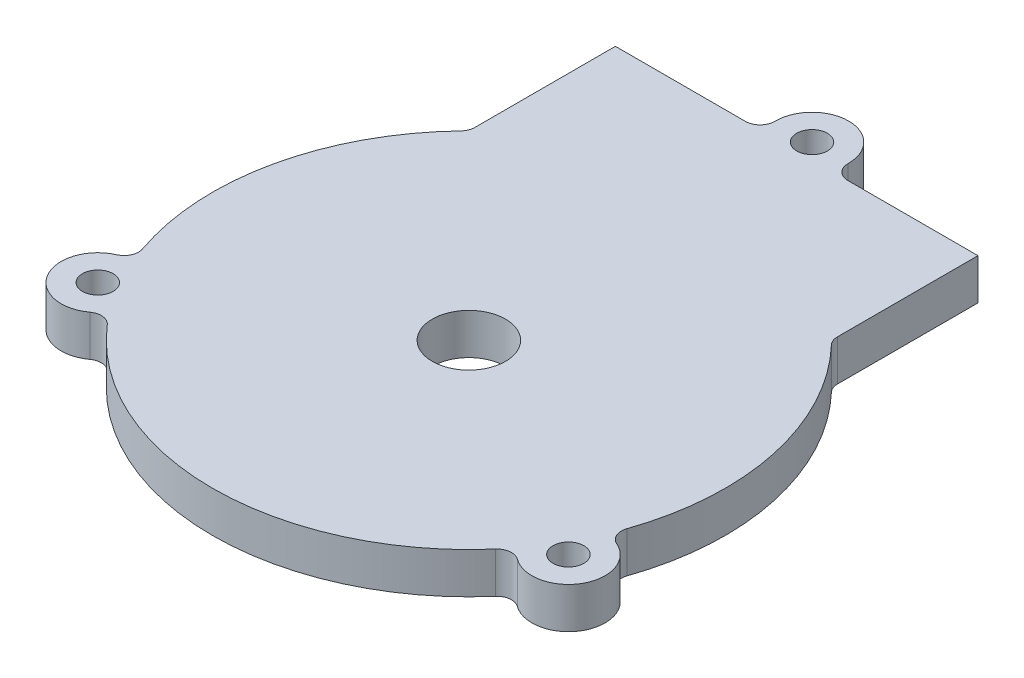
ISO-10303-21;
HEADER;
FILE_DESCRIPTION(('STEP AP214'),'2;1');
FILE_NAME('part.step','',(''),(''),'','','');
FILE_SCHEMA(('AUTOMOTIVE_DESIGN { 1 0 10303 214 1 1 1 1 }'));
ENDSEC;
DATA;
#1=APPLICATION_CONTEXT('core data for automotive mechanical design processes');
#2=APPLICATION_PROTOCOL_DEFINITION('international standard','automotive_design',2000,#1);
#3=PRODUCT_CONTEXT('',#1,'mechanical');
#4=PRODUCT('Part','Part','',(#3));
#5=PRODUCT_RELATED_PRODUCT_CATEGORY('part','',(#4));
#6=PRODUCT_DEFINITION_FORMATION('','',#4);
#7=PRODUCT_DEFINITION_CONTEXT('part definition',#1,'design');
#8=PRODUCT_DEFINITION('design','',#6,#7);
#9=PRODUCT_DEFINITION_SHAPE('','',#8);
#10=(LENGTH_UNIT() NAMED_UNIT(*) SI_UNIT(.MILLI.,.METRE.));
#11=(NAMED_UNIT(*) PLANE_ANGLE_UNIT() SI_UNIT($,.RADIAN.));
#12=(NAMED_UNIT(*) SI_UNIT($,.STERADIAN.) SOLID_ANGLE_UNIT());
#13=UNCERTAINTY_MEASURE_WITH_UNIT(LENGTH_MEASURE(1.E-05),#10,'distance_accuracy_value','');
#14=(GEOMETRIC_REPRESENTATION_CONTEXT(3) GLOBAL_UNCERTAINTY_ASSIGNED_CONTEXT((#13)) GLOBAL_UNIT_ASSIGNED_CONTEXT((#10,
#11,#12)) REPRESENTATION_CONTEXT('',''));
#15=CARTESIAN_POINT('',(0.,0.,0.));
#16=DIRECTION('',(0.,0.,1.));
#17=DIRECTION('',(1.,0.,0.));
#18=AXIS2_PLACEMENT_3D('',#15,#16,#17);
#19=CARTESIAN_POINT('',(0.,5.588,0.));
#20=DIRECTION('',(0.,-1.,0.));
#21=DIRECTION('',(0.,0.,-1.));
#22=AXIS2_PLACEMENT_3D('',#19,#20,#21);
#23=CYLINDRICAL_SURFACE('',#22,35.);
#24=CARTESIAN_POINT('',(0.,0.,0.));
#25=DIRECTION('',(0.,1.,0.));
#26=DIRECTION('',(0.,0.,1.));
#27=AXIS2_PLACEMENT_3D('',#24,#25,#26);
#28=CIRCLE('',#27,35.);
#29=CARTESIAN_POINT('',(-25.3019754085747,0.,-24.1828459951239));
#30=VERTEX_POINT('',#29);
#31=CARTESIAN_POINT('',(-33.072840065109,0.,11.4537002766671));
#32=VERTEX_POINT('',#31);
#33=EDGE_CURVE('E211',#30,#32,#28,.T.);
#34=ORIENTED_EDGE('',*,*,#33,.T.);
#35=DIRECTION('',(0.,-1.,0.));
#36=VECTOR('',#35,1.);
#37=CARTESIAN_POINT('',(-33.072840065109,5.588,11.4537002766671));
#38=LINE('',#37,#36);
#39=CARTESIAN_POINT('',(-33.072840065109,5.588,11.4537002766671));
#40=VERTEX_POINT('',#39);
#41=EDGE_CURVE('E224',#32,#40,#38,.F.);
#42=ORIENTED_EDGE('',*,*,#41,.T.);
#43=CARTESIAN_POINT('',(0.,5.588,0.));
#44=DIRECTION('',(0.,1.,0.));
#45=DIRECTION('',(0.,0.,1.));
#46=AXIS2_PLACEMENT_3D('',#43,#44,#45);
#47=CIRCLE('',#46,35.);
#48=CARTESIAN_POINT('',(-25.3019754085747,5.588,-24.1828459951239));
#49=VERTEX_POINT('',#48);
#50=EDGE_CURVE('E205',#49,#40,#47,.T.);
#51=ORIENTED_EDGE('',*,*,#50,.F.);
#52=DIRECTION('',(0.,-1.,0.));
#53=VECTOR('',#52,1.);
#54=CARTESIAN_POINT('',(-25.3019754085747,5.588,-24.1828459951239));
#55=LINE('',#54,#53);
#56=EDGE_CURVE('E218',#49,#30,#55,.T.);
#57=ORIENTED_EDGE('',*,*,#56,.T.);
#58=EDGE_LOOP('',(#34,#42,#51,#57));
#59=FACE_BOUND('',#58,.T.);
#60=ADVANCED_FACE('F42',(#59),#23,.T.);
#61=CARTESIAN_POINT('',(-26.5021889393046,0.,22.8611894140572));
#62=VERTEX_POINT('',#61);
#63=CARTESIAN_POINT('',(26.4887144081727,0.,22.8768006723464));
#64=VERTEX_POINT('',#63);
#65=EDGE_CURVE('E214',#62,#64,#28,.T.);
#66=ORIENTED_EDGE('',*,*,#65,.T.);
#67=DIRECTION('',(0.,-1.,0.));
#68=VECTOR('',#67,1.);
#69=CARTESIAN_POINT('',(26.4887144081727,5.588,22.8768006723464));
#70=LINE('',#69,#68);
#71=CARTESIAN_POINT('',(26.4887144081727,5.588,22.8768006723464));
#72=VERTEX_POINT('',#71);
#73=EDGE_CURVE('E243',#64,#72,#70,.F.);
#74=ORIENTED_EDGE('',*,*,#73,.T.);
#75=CARTESIAN_POINT('',(-26.5021889393046,5.588,22.8611894140572));
#76=VERTEX_POINT('',#75);
#77=EDGE_CURVE('E209',#76,#72,#47,.T.);
#78=ORIENTED_EDGE('',*,*,#77,.F.);
#79=DIRECTION('',(0.,-1.,0.));
#80=VECTOR('',#79,1.);
#81=CARTESIAN_POINT('',(-26.5021889393046,5.588,22.8611894140572));
#82=LINE('',#81,#80);
#83=EDGE_CURVE('E234',#76,#62,#82,.T.);
#84=ORIENTED_EDGE('',*,*,#83,.T.);
#85=EDGE_LOOP('',(#66,#74,#78,#84));
#86=FACE_BOUND('',#85,.T.);
#87=ADVANCED_FACE('F365',(#86),#23,.T.);
#88=CARTESIAN_POINT('',(-24.7478605121482,-53.381962685779,-44.7452325826062));
#89=DIRECTION('',(3.0206381024394E-06,0.,0.999999999995438));
#90=DIRECTION('',(0.999999999995438,0.,-3.0206381024394E-06));
#91=AXIS2_PLACEMENT_3D('',#88,#89,#90);
#92=PLANE('',#91);
#93=DIRECTION('',(0.999999999995438,0.,-3.0206381024394E-06));
#94=VECTOR('',#93,1.);
#95=CARTESIAN_POINT('',(-24.7478605121482,5.588,-44.7452325826062));
#96=LINE('',#95,#94);
#97=CARTESIAN_POINT('',(-24.7478605121482,5.588,-44.7452325826062));
#98=VERTEX_POINT('',#97);
#99=CARTESIAN_POINT('',(-6.99532394188785,5.588,-44.7452862065945));
#100=VERTEX_POINT('',#99);
#101=EDGE_CURVE('E177',#98,#100,#96,.T.);
#102=ORIENTED_EDGE('',*,*,#101,.T.);
#103=DIRECTION('',(0.,1.,0.));
#104=VECTOR('',#103,1.);
#105=CARTESIAN_POINT('',(-6.99532394188785,-53.381962685779,-44.7452862065945));
#106=LINE('',#105,#104);
#107=CARTESIAN_POINT('',(-6.99532394188785,0.,-44.7452862065945));
#108=VERTEX_POINT('',#107);
#109=EDGE_CURVE('E277',#100,#108,#106,.F.);
#110=ORIENTED_EDGE('',*,*,#109,.T.);
#111=DIRECTION('',(-0.999999999995438,0.,3.0206381024394E-06));
#112=VECTOR('',#111,1.);
#113=CARTESIAN_POINT('',(-24.7478605121482,0.,-44.7452325826062));
#114=LINE('',#113,#112);
#115=CARTESIAN_POINT('',(-24.7478605121482,0.,-44.7452325826062));
#116=VERTEX_POINT('',#115);
#117=EDGE_CURVE('E198',#108,#116,#114,.T.);
#118=ORIENTED_EDGE('',*,*,#117,.T.);
#119=DIRECTION('',(0.,1.,0.));
#120=VECTOR('',#119,1.);
#121=CARTESIAN_POINT('',(-24.7478605121482,-53.381962685779,-44.7452325826062));
#122=LINE('',#121,#120);
#123=EDGE_CURVE('E194',#116,#98,#122,.T.);
#124=ORIENTED_EDGE('',*,*,#123,.T.);
#125=EDGE_LOOP('',(#102,#110,#118,#124));
#126=FACE_BOUND('',#125,.T.);
#127=ADVANCED_FACE('F283',(#126),#92,.F.);
#128=CARTESIAN_POINT('',(33.0630730181294,0.,11.4818640733046));
#129=VERTEX_POINT('',#128);
#130=CARTESIAN_POINT('',(25.3018293128609,0.,-24.1829988509046));
#131=VERTEX_POINT('',#130);
#132=EDGE_CURVE('E215',#129,#131,#28,.T.);
#133=ORIENTED_EDGE('',*,*,#132,.T.);
#134=DIRECTION('',(0.,-1.,0.));
#135=VECTOR('',#134,1.);
#136=CARTESIAN_POINT('',(25.3018293128609,5.588,-24.1829988509046));
#137=LINE('',#136,#135);
#138=CARTESIAN_POINT('',(25.3018293128609,5.588,-24.1829988509046));
#139=VERTEX_POINT('',#138);
#140=EDGE_CURVE('E262',#131,#139,#137,.F.);
#141=ORIENTED_EDGE('',*,*,#140,.T.);
#142=CARTESIAN_POINT('',(33.0630730181294,5.588,11.4818640733046));
#143=VERTEX_POINT('',#142);
#144=EDGE_CURVE('E210',#143,#139,#47,.T.);
#145=ORIENTED_EDGE('',*,*,#144,.F.);
#146=DIRECTION('',(0.,-1.,0.));
#147=VECTOR('',#146,1.);
#148=CARTESIAN_POINT('',(33.0630730181294,5.588,11.4818640733046));
#149=LINE('',#148,#147);
#150=EDGE_CURVE('E253',#143,#129,#149,.T.);
#151=ORIENTED_EDGE('',*,*,#150,.T.);
#152=EDGE_LOOP('',(#133,#141,#145,#151));
#153=FACE_BOUND('',#152,.T.);
#154=ADVANCED_FACE('F342',(#153),#23,.T.);
#155=CARTESIAN_POINT('',(0.,5.588,0.));
#156=DIRECTION('',(0.,1.,0.));
#157=DIRECTION('',(0.,0.,1.));
#158=AXIS2_PLACEMENT_3D('',#155,#156,#157);
#159=PLANE('',#158);
#160=CARTESIAN_POINT('',(0.,5.588,0.));
#161=DIRECTION('',(0.,1.,0.));
#162=DIRECTION('',(0.,0.,1.));
#163=AXIS2_PLACEMENT_3D('',#160,#161,#162);
#164=CIRCLE('',#163,5.);
#165=CARTESIAN_POINT('',(0.,5.588,5.));
#166=VERTEX_POINT('',#165);
#167=EDGE_CURVE('E334',#166,#166,#164,.T.);
#168=ORIENTED_EDGE('',*,*,#167,.F.);
#169=EDGE_LOOP('',(#168));
#170=FACE_BOUND('',#169,.T.);
#171=CARTESIAN_POINT('',(-32.1480166138315,5.588,18.5087961651664));
#172=DIRECTION('',(0.,1.,0.));
#173=DIRECTION('',(0.,0.,1.));
#174=AXIS2_PLACEMENT_3D('',#171,#172,#173);
#175=CIRCLE('',#174,2.09999999999999);
#176=CARTESIAN_POINT('',(-32.1480166138315,5.588,20.6087961651664));
#177=VERTEX_POINT('',#176);
#178=EDGE_CURVE('E328',#177,#177,#175,.T.);
#179=ORIENTED_EDGE('',*,*,#178,.F.);
#180=EDGE_LOOP('',(#179));
#181=FACE_BOUND('',#180,.T.);
#182=DIRECTION('',(-3.02063810260161E-06,0.,-0.999999999995438));
#183=VECTOR('',#182,1.);
#184=CARTESIAN_POINT('',(-24.7478001128037,5.588,-24.7496745347634));
#185=LINE('',#184,#183);
#186=CARTESIAN_POINT('',(-24.7478025747881,5.588,-25.5647289504072));
#187=VERTEX_POINT('',#186);
#188=EDGE_CURVE('E195',#187,#98,#185,.T.);
#189=ORIENTED_EDGE('',*,*,#188,.F.);
#190=CARTESIAN_POINT('',(-26.747802574779,5.588,-25.564722909131));
#191=DIRECTION('',(0.,1.,0.));
#192=DIRECTION('',(0.,0.,1.));
#193=AXIS2_PLACEMENT_3D('',#190,#191,#192);
#194=CIRCLE('',#193,2.);
#195=EDGE_CURVE('E220',#187,#49,#194,.F.);
#196=ORIENTED_EDGE('',*,*,#195,.T.);
#197=ORIENTED_EDGE('',*,*,#50,.T.);
#198=CARTESIAN_POINT('',(-34.9627166402581,5.588,12.1081974353338));
#199=DIRECTION('',(0.,1.,0.));
#200=DIRECTION('',(0.,0.,1.));
#201=AXIS2_PLACEMENT_3D('',#198,#199,#200);
#202=CIRCLE('',#201,2.);
#203=CARTESIAN_POINT('',(-34.1580179965192,5.588,13.9391698799011));
#204=VERTEX_POINT('',#203);
#205=EDGE_CURVE('E230',#40,#204,#202,.F.);
#206=ORIENTED_EDGE('',*,*,#205,.T.);
#207=CARTESIAN_POINT('',(-32.1464555555357,5.588,18.5161819435163));
#208=DIRECTION('',(0.,1.,0.));
#209=DIRECTION('',(0.,0.,1.));
#210=AXIS2_PLACEMENT_3D('',#207,#208,#209);
#211=CIRCLE('',#210,4.99954226749351);
#212=CARTESIAN_POINT('',(-29.1966357044392,5.588,22.5527628891349));
#213=VERTEX_POINT('',#212);
#214=EDGE_CURVE('E322',#204,#213,#211,.T.);
#215=ORIENTED_EDGE('',*,*,#214,.T.);
#216=CARTESIAN_POINT('',(-28.0165997358363,5.588,24.1675430948605));
#217=DIRECTION('',(0.,1.,0.));
#218=DIRECTION('',(0.,0.,1.));
#219=AXIS2_PLACEMENT_3D('',#216,#217,#218);
#220=CIRCLE('',#219,2.);
#221=EDGE_CURVE('E241',#213,#76,#220,.F.);
#222=ORIENTED_EDGE('',*,*,#221,.T.);
#223=ORIENTED_EDGE('',*,*,#77,.T.);
#224=CARTESIAN_POINT('',(28.0023552314968,5.588,24.1840464250519));
#225=DIRECTION('',(0.,1.,0.));
#226=DIRECTION('',(0.,0.,1.));
#227=AXIS2_PLACEMENT_3D('',#224,#225,#226);
#228=CIRCLE('',#227,2.);
#229=CARTESIAN_POINT('',(29.184359284545,5.588,22.5707062815676));
#230=VERTEX_POINT('',#229);
#231=EDGE_CURVE('E249',#72,#230,#228,.F.);
#232=ORIENTED_EDGE('',*,*,#231,.T.);
#233=CARTESIAN_POINT('',(32.1364886347761,5.588,18.5412879583363));
#234=DIRECTION('',(0.,1.,0.));
#235=DIRECTION('',(0.,0.,1.));
#236=AXIS2_PLACEMENT_3D('',#233,#234,#235);
#237=CIRCLE('',#236,4.9951255964279);
#238=CARTESIAN_POINT('',(34.147287178261,5.588,13.9687647007018));
#239=VERTEX_POINT('',#238);
#240=EDGE_CURVE('E311',#230,#239,#237,.T.);
#241=ORIENTED_EDGE('',*,*,#240,.T.);
#242=CARTESIAN_POINT('',(34.9523914763083,5.588,12.1379705917791));
#243=DIRECTION('',(0.,1.,0.));
#244=DIRECTION('',(0.,0.,1.));
#245=AXIS2_PLACEMENT_3D('',#242,#243,#244);
#246=CIRCLE('',#245,2.);
#247=EDGE_CURVE('E260',#239,#143,#246,.F.);
#248=ORIENTED_EDGE('',*,*,#247,.T.);
#249=ORIENTED_EDGE('',*,*,#144,.T.);
#250=CARTESIAN_POINT('',(26.7476481307387,5.588,-25.5648844995277));
#251=DIRECTION('',(0.,1.,0.));
#252=DIRECTION('',(0.,0.,1.));
#253=AXIS2_PLACEMENT_3D('',#250,#251,#252);
#254=CIRCLE('',#253,2.);
#255=CARTESIAN_POINT('',(24.7476481307478,5.588,-25.5648784582515));
#256=VERTEX_POINT('',#255);
#257=EDGE_CURVE('E185',#139,#256,#254,.F.);
#258=ORIENTED_EDGE('',*,*,#257,.T.);
#259=DIRECTION('',(-3.02063810260161E-06,0.,-0.999999999995438));
#260=VECTOR('',#259,1.);
#261=CARTESIAN_POINT('',(24.7476505927322,5.588,-24.7498240426077));
#262=LINE('',#261,#260);
#263=CARTESIAN_POINT('',(24.7475901933877,5.588,-44.7453820904505));
#264=VERTEX_POINT('',#263);
#265=EDGE_CURVE('E178',#256,#264,#262,.T.);
#266=ORIENTED_EDGE('',*,*,#265,.T.);
#267=CARTESIAN_POINT('',(6.99533660471705,5.588,-44.7453284673169));
#268=VERTEX_POINT('',#267);
#269=EDGE_CURVE('E168',#268,#264,#96,.T.);
#270=ORIENTED_EDGE('',*,*,#269,.F.);
#271=CARTESIAN_POINT('',(6.99533056344084,5.588,-46.7453284673078));
#272=DIRECTION('',(0.,1.,0.));
#273=DIRECTION('',(0.,0.,1.));
#274=AXIS2_PLACEMENT_3D('',#271,#272,#273);
#275=CIRCLE('',#274,2.);
#276=CARTESIAN_POINT('',(4.99551899083441,5.588,-46.7727815922561));
#277=VERTEX_POINT('',#276);
#278=EDGE_CURVE('E273',#268,#277,#275,.F.);
#279=ORIENTED_EDGE('',*,*,#278,.T.);
#280=CARTESIAN_POINT('',(0.,5.588,-46.8413593567393));
#281=DIRECTION('',(0.,1.,0.));
#282=DIRECTION('',(0.,0.,1.));
#283=AXIS2_PLACEMENT_3D('',#280,#281,#282);
#284=CIRCLE('',#283,4.99598968149142);
#285=CARTESIAN_POINT('',(-4.99551857644603,5.588,-46.7727514129473));
#286=VERTEX_POINT('',#285);
#287=EDGE_CURVE('E300',#277,#286,#284,.T.);
#288=ORIENTED_EDGE('',*,*,#287,.T.);
#289=CARTESIAN_POINT('',(-6.99532998316405,5.588,-46.7452862065854));
#290=DIRECTION('',(0.,1.,0.));
#291=DIRECTION('',(0.,0.,1.));
#292=AXIS2_PLACEMENT_3D('',#289,#290,#291);
#293=CIRCLE('',#292,2.);
#294=EDGE_CURVE('E12',#286,#100,#293,.F.);
#295=ORIENTED_EDGE('',*,*,#294,.T.);
#296=ORIENTED_EDGE('',*,*,#101,.F.);
#297=EDGE_LOOP('',(#189,#196,#197,#206,#215,#222,#223,#232,#241,#248,#249,#258,#266,#270,#279,
#288,#295,#296));
#298=FACE_BOUND('',#297,.T.);
#299=CARTESIAN_POINT('',(32.1247811991366,5.588,18.5356173256723));
#300=DIRECTION('',(0.,1.,0.));
#301=DIRECTION('',(0.,0.,1.));
#302=AXIS2_PLACEMENT_3D('',#299,#300,#301);
#303=CIRCLE('',#302,2.1);
#304=CARTESIAN_POINT('',(32.1247811991366,5.588,20.6356173256723));
#305=VERTEX_POINT('',#304);
#306=EDGE_CURVE('E317',#305,#305,#303,.T.);
#307=ORIENTED_EDGE('',*,*,#306,.F.);
#308=EDGE_LOOP('',(#307));
#309=FACE_BOUND('',#308,.T.);
#310=CARTESIAN_POINT('',(0.,5.588,-46.8413593567393));
#311=DIRECTION('',(0.,1.,0.));
#312=DIRECTION('',(0.,0.,1.));
#313=AXIS2_PLACEMENT_3D('',#310,#311,#312);
#314=CIRCLE('',#313,2.09605202456873);
#315=CARTESIAN_POINT('',(0.,5.588,-44.7453073321706));
#316=VERTEX_POINT('',#315);
#317=EDGE_CURVE('E304',#316,#316,#314,.T.);
#318=ORIENTED_EDGE('',*,*,#317,.F.);
#319=EDGE_LOOP('',(#318));
#320=FACE_BOUND('',#319,.T.);
#321=ADVANCED_FACE('F182',(#170,#181,#298,#309,#320),#159,.T.);
#322=CARTESIAN_POINT('',(0.,0.,0.));
#323=DIRECTION('',(0.,1.,0.));
#324=DIRECTION('',(0.,0.,1.));
#325=AXIS2_PLACEMENT_3D('',#322,#323,#324);
#326=PLANE('',#325);
#327=CARTESIAN_POINT('',(0.,0.,0.));
#328=DIRECTION('',(0.,1.,0.));
#329=DIRECTION('',(0.,0.,1.));
#330=AXIS2_PLACEMENT_3D('',#327,#328,#329);
#331=CIRCLE('',#330,5.);
#332=CARTESIAN_POINT('',(0.,0.,5.));
#333=VERTEX_POINT('',#332);
#334=EDGE_CURVE('E331',#333,#333,#331,.F.);
#335=ORIENTED_EDGE('',*,*,#334,.F.);
#336=EDGE_LOOP('',(#335));
#337=FACE_BOUND('',#336,.T.);
#338=CARTESIAN_POINT('',(-32.1480166138315,0.,18.5087961651664));
#339=DIRECTION('',(0.,1.,0.));
#340=DIRECTION('',(0.,0.,1.));
#341=AXIS2_PLACEMENT_3D('',#338,#339,#340);
#342=CIRCLE('',#341,2.1);
#343=CARTESIAN_POINT('',(-32.1480166138315,0.,20.6087961651664));
#344=VERTEX_POINT('',#343);
#345=EDGE_CURVE('E325',#344,#344,#342,.T.);
#346=ORIENTED_EDGE('',*,*,#345,.T.);
#347=EDGE_LOOP('',(#346));
#348=FACE_BOUND('',#347,.T.);
#349=CARTESIAN_POINT('',(32.1247811991366,0.,18.5356173256723));
#350=DIRECTION('',(0.,1.,0.));
#351=DIRECTION('',(0.,0.,1.));
#352=AXIS2_PLACEMENT_3D('',#349,#350,#351);
#353=CIRCLE('',#352,2.1);
#354=CARTESIAN_POINT('',(32.1247811991366,0.,20.6356173256723));
#355=VERTEX_POINT('',#354);
#356=EDGE_CURVE('E314',#355,#355,#353,.T.);
#357=ORIENTED_EDGE('',*,*,#356,.T.);
#358=EDGE_LOOP('',(#357));
#359=FACE_BOUND('',#358,.T.);
#360=CARTESIAN_POINT('',(0.,0.,-46.8413593567393));
#361=DIRECTION('',(0.,1.,0.));
#362=DIRECTION('',(0.,0.,1.));
#363=AXIS2_PLACEMENT_3D('',#360,#361,#362);
#364=CIRCLE('',#363,2.09605202456873);
#365=CARTESIAN_POINT('',(0.,0.,-44.7453073321706));
#366=VERTEX_POINT('',#365);
#367=EDGE_CURVE('E302',#366,#366,#364,.T.);
#368=ORIENTED_EDGE('',*,*,#367,.T.);
#369=EDGE_LOOP('',(#368));
#370=FACE_BOUND('',#369,.T.);
#371=ORIENTED_EDGE('',*,*,#65,.F.);
#372=CARTESIAN_POINT('',(-28.0165997358363,0.,24.1675430948605));
#373=DIRECTION('',(0.,1.,0.));
#374=DIRECTION('',(0.,0.,1.));
#375=AXIS2_PLACEMENT_3D('',#372,#373,#374);
#376=CIRCLE('',#375,2.);
#377=CARTESIAN_POINT('',(-29.1966357044392,0.,22.5527628891349));
#378=VERTEX_POINT('',#377);
#379=EDGE_CURVE('E239',#62,#378,#376,.T.);
#380=ORIENTED_EDGE('',*,*,#379,.T.);
#381=CARTESIAN_POINT('',(-32.1464555555357,0.,18.5161819435163));
#382=DIRECTION('',(0.,1.,0.));
#383=DIRECTION('',(0.,0.,1.));
#384=AXIS2_PLACEMENT_3D('',#381,#382,#383);
#385=CIRCLE('',#384,4.99954226749351);
#386=CARTESIAN_POINT('',(-34.1580179965192,0.,13.9391698799011));
#387=VERTEX_POINT('',#386);
#388=EDGE_CURVE('E320',#378,#387,#385,.F.);
#389=ORIENTED_EDGE('',*,*,#388,.T.);
#390=CARTESIAN_POINT('',(-34.9627166402581,0.,12.1081974353338));
#391=DIRECTION('',(0.,1.,0.));
#392=DIRECTION('',(0.,0.,1.));
#393=AXIS2_PLACEMENT_3D('',#390,#391,#392);
#394=CIRCLE('',#393,2.);
#395=EDGE_CURVE('E232',#387,#32,#394,.T.);
#396=ORIENTED_EDGE('',*,*,#395,.T.);
#397=ORIENTED_EDGE('',*,*,#33,.F.);
#398=CARTESIAN_POINT('',(-26.747802574779,0.,-25.564722909131));
#399=DIRECTION('',(0.,1.,0.));
#400=DIRECTION('',(0.,0.,1.));
#401=AXIS2_PLACEMENT_3D('',#398,#399,#400);
#402=CIRCLE('',#401,2.);
#403=CARTESIAN_POINT('',(-24.7478025747881,0.,-25.5647289504072));
#404=VERTEX_POINT('',#403);
#405=EDGE_CURVE('E222',#30,#404,#402,.T.);
#406=ORIENTED_EDGE('',*,*,#405,.T.);
#407=DIRECTION('',(3.02063810260161E-06,0.,0.999999999995438));
#408=VECTOR('',#407,1.);
#409=CARTESIAN_POINT('',(-24.7478001128037,0.,-24.7496745347634));
#410=LINE('',#409,#408);
#411=EDGE_CURVE('E204',#116,#404,#410,.T.);
#412=ORIENTED_EDGE('',*,*,#411,.F.);
#413=ORIENTED_EDGE('',*,*,#117,.F.);
#414=CARTESIAN_POINT('',(-6.99532998316405,0.,-46.7452862065854));
#415=DIRECTION('',(0.,1.,0.));
#416=DIRECTION('',(0.,0.,1.));
#417=AXIS2_PLACEMENT_3D('',#414,#415,#416);
#418=CIRCLE('',#417,2.);
#419=CARTESIAN_POINT('',(-4.99551857644603,0.,-46.7727514129473));
#420=VERTEX_POINT('',#419);
#421=EDGE_CURVE('E50',#108,#420,#418,.T.);
#422=ORIENTED_EDGE('',*,*,#421,.T.);
#423=CARTESIAN_POINT('',(0.,0.,-46.8413593567393));
#424=DIRECTION('',(0.,1.,0.));
#425=DIRECTION('',(0.,0.,1.));
#426=AXIS2_PLACEMENT_3D('',#423,#424,#425);
#427=CIRCLE('',#426,4.99598968149142);
#428=CARTESIAN_POINT('',(4.99551899083441,0.,-46.7727815922561));
#429=VERTEX_POINT('',#428);
#430=EDGE_CURVE('E188',#429,#420,#427,.T.);
#431=ORIENTED_EDGE('',*,*,#430,.F.);
#432=CARTESIAN_POINT('',(6.99533056344084,0.,-46.7453284673078));
#433=DIRECTION('',(0.,1.,0.));
#434=DIRECTION('',(0.,0.,1.));
#435=AXIS2_PLACEMENT_3D('',#432,#433,#434);
#436=CIRCLE('',#435,2.);
#437=CARTESIAN_POINT('',(6.99533660471705,0.,-44.7453284673169));
#438=VERTEX_POINT('',#437);
#439=EDGE_CURVE('E275',#429,#438,#436,.T.);
#440=ORIENTED_EDGE('',*,*,#439,.T.);
#441=CARTESIAN_POINT('',(24.7475901933877,0.,-44.7453820904505));
#442=VERTEX_POINT('',#441);
#443=EDGE_CURVE('E202',#442,#438,#114,.T.);
#444=ORIENTED_EDGE('',*,*,#443,.F.);
#445=DIRECTION('',(3.02063810260161E-06,0.,0.999999999995438));
#446=VECTOR('',#445,1.);
#447=CARTESIAN_POINT('',(24.7476505927322,0.,-24.7498240426077));
#448=LINE('',#447,#446);
#449=CARTESIAN_POINT('',(24.7476481307478,0.,-25.5648784582515));
#450=VERTEX_POINT('',#449);
#451=EDGE_CURVE('E193',#442,#450,#448,.T.);
#452=ORIENTED_EDGE('',*,*,#451,.T.);
#453=CARTESIAN_POINT('',(26.7476481307387,0.,-25.5648844995277));
#454=DIRECTION('',(0.,1.,0.));
#455=DIRECTION('',(0.,0.,1.));
#456=AXIS2_PLACEMENT_3D('',#453,#454,#455);
#457=CIRCLE('',#456,2.);
#458=EDGE_CURVE('E268',#450,#131,#457,.T.);
#459=ORIENTED_EDGE('',*,*,#458,.T.);
#460=ORIENTED_EDGE('',*,*,#132,.F.);
#461=CARTESIAN_POINT('',(34.9523914763083,0.,12.1379705917791));
#462=DIRECTION('',(0.,1.,0.));
#463=DIRECTION('',(0.,0.,1.));
#464=AXIS2_PLACEMENT_3D('',#461,#462,#463);
#465=CIRCLE('',#464,2.);
#466=CARTESIAN_POINT('',(34.147287178261,0.,13.9687647007018));
#467=VERTEX_POINT('',#466);
#468=EDGE_CURVE('E258',#129,#467,#465,.T.);
#469=ORIENTED_EDGE('',*,*,#468,.T.);
#470=CARTESIAN_POINT('',(32.1364886347761,0.,18.5412879583363));
#471=DIRECTION('',(0.,1.,0.));
#472=DIRECTION('',(0.,0.,1.));
#473=AXIS2_PLACEMENT_3D('',#470,#471,#472);
#474=CIRCLE('',#473,4.9951255964279);
#475=CARTESIAN_POINT('',(29.184359284545,0.,22.5707062815676));
#476=VERTEX_POINT('',#475);
#477=EDGE_CURVE('E307',#467,#476,#474,.F.);
#478=ORIENTED_EDGE('',*,*,#477,.T.);
#479=CARTESIAN_POINT('',(28.0023552314968,0.,24.1840464250519));
#480=DIRECTION('',(0.,1.,0.));
#481=DIRECTION('',(0.,0.,1.));
#482=AXIS2_PLACEMENT_3D('',#479,#480,#481);
#483=CIRCLE('',#482,2.);
#484=EDGE_CURVE('E251',#476,#64,#483,.T.);
#485=ORIENTED_EDGE('',*,*,#484,.T.);
#486=EDGE_LOOP('',(#371,#380,#389,#396,#397,#406,#412,#413,#422,#431,#440,#444,#452,#459,#460,
#469,#478,#485));
#487=FACE_BOUND('',#486,.T.);
#488=ADVANCED_FACE('F289',(#337,#348,#359,#370,#487),#326,.F.);
#489=ORIENTED_EDGE('',*,*,#443,.T.);
#490=DIRECTION('',(0.,1.,0.));
#491=VECTOR('',#490,1.);
#492=CARTESIAN_POINT('',(6.99533660471704,-53.381962685779,-44.7453284673169));
#493=LINE('',#492,#491);
#494=EDGE_CURVE('E175',#438,#268,#493,.T.);
#495=ORIENTED_EDGE('',*,*,#494,.T.);
#496=ORIENTED_EDGE('',*,*,#269,.T.);
#497=DIRECTION('',(0.,1.,0.));
#498=VECTOR('',#497,1.);
#499=CARTESIAN_POINT('',(24.7475901933877,-53.381962685779,-44.7453820904505));
#500=LINE('',#499,#498);
#501=EDGE_CURVE('E173',#442,#264,#500,.T.);
#502=ORIENTED_EDGE('',*,*,#501,.F.);
#503=EDGE_LOOP('',(#489,#495,#496,#502));
#504=FACE_BOUND('',#503,.T.);
#505=ADVANCED_FACE('F171',(#504),#92,.F.);
#506=CARTESIAN_POINT('',(-24.7478001128037,-53.381962685779,-24.7496745347634));
#507=DIRECTION('',(0.999999999995438,0.,-3.02063810260161E-06));
#508=DIRECTION('',(-3.02063810260161E-06,0.,-0.999999999995438));
#509=AXIS2_PLACEMENT_3D('',#506,#507,#508);
#510=PLANE('',#509);
#511=ORIENTED_EDGE('',*,*,#411,.T.);
#512=DIRECTION('',(0.,1.,0.));
#513=VECTOR('',#512,1.);
#514=CARTESIAN_POINT('',(-24.7478025747881,5.588,-25.5647289504072));
#515=LINE('',#514,#513);
#516=EDGE_CURVE('E208',#404,#187,#515,.T.);
#517=ORIENTED_EDGE('',*,*,#516,.T.);
#518=ORIENTED_EDGE('',*,*,#188,.T.);
#519=ORIENTED_EDGE('',*,*,#123,.F.);
#520=EDGE_LOOP('',(#511,#517,#518,#519));
#521=FACE_BOUND('',#520,.T.);
#522=ADVANCED_FACE('F297',(#521),#510,.F.);
#523=CARTESIAN_POINT('',(24.7476505927322,-53.381962685779,-24.7498240426077));
#524=DIRECTION('',(0.999999999995438,0.,-3.02063810260161E-06));
#525=DIRECTION('',(-3.02063810260161E-06,0.,-0.999999999995438));
#526=AXIS2_PLACEMENT_3D('',#523,#524,#525);
#527=PLANE('',#526);
#528=ORIENTED_EDGE('',*,*,#265,.F.);
#529=DIRECTION('',(0.,-1.,0.));
#530=VECTOR('',#529,1.);
#531=CARTESIAN_POINT('',(24.7476481307478,-53.381962685779,-25.5648784582515));
#532=LINE('',#531,#530);
#533=EDGE_CURVE('E265',#256,#450,#532,.T.);
#534=ORIENTED_EDGE('',*,*,#533,.T.);
#535=ORIENTED_EDGE('',*,*,#451,.F.);
#536=ORIENTED_EDGE('',*,*,#501,.T.);
#537=EDGE_LOOP('',(#528,#534,#535,#536));
#538=FACE_BOUND('',#537,.T.);
#539=ADVANCED_FACE('F191',(#538),#527,.T.);
#540=CARTESIAN_POINT('',(0.,0.,-46.8413593567393));
#541=DIRECTION('',(0.,1.,0.));
#542=DIRECTION('',(0.,0.,1.));
#543=AXIS2_PLACEMENT_3D('',#540,#541,#542);
#544=CYLINDRICAL_SURFACE('',#543,4.99598968149142);
#545=ORIENTED_EDGE('',*,*,#430,.T.);
#546=DIRECTION('',(0.,1.,0.));
#547=VECTOR('',#546,1.);
#548=CARTESIAN_POINT('',(-4.99551857644604,0.,-46.7727514129473));
#549=LINE('',#548,#547);
#550=EDGE_CURVE('E63',#420,#286,#549,.T.);
#551=ORIENTED_EDGE('',*,*,#550,.T.);
#552=ORIENTED_EDGE('',*,*,#287,.F.);
#553=DIRECTION('',(0.,1.,0.));
#554=VECTOR('',#553,1.);
#555=CARTESIAN_POINT('',(4.99551899083441,0.,-46.7727815922561));
#556=LINE('',#555,#554);
#557=EDGE_CURVE('E271',#277,#429,#556,.F.);
#558=ORIENTED_EDGE('',*,*,#557,.T.);
#559=EDGE_LOOP('',(#545,#551,#552,#558));
#560=FACE_BOUND('',#559,.T.);
#561=ADVANCED_FACE('F391',(#560),#544,.T.);
#562=CARTESIAN_POINT('',(0.,0.,-46.8413593567393));
#563=DIRECTION('',(0.,1.,0.));
#564=DIRECTION('',(0.,0.,1.));
#565=AXIS2_PLACEMENT_3D('',#562,#563,#564);
#566=CYLINDRICAL_SURFACE('',#565,2.09605202456873);
#567=ORIENTED_EDGE('',*,*,#317,.T.);
#568=EDGE_LOOP('',(#567));
#569=FACE_BOUND('',#568,.T.);
#570=ORIENTED_EDGE('',*,*,#367,.F.);
#571=EDGE_LOOP('',(#570));
#572=FACE_BOUND('',#571,.T.);
#573=ADVANCED_FACE('F442',(#569,#572),#566,.F.);
#574=CARTESIAN_POINT('',(32.1364886347761,-14.1283487284507,18.5412879583363));
#575=DIRECTION('',(0.,1.,0.));
#576=DIRECTION('',(0.,0.,1.));
#577=AXIS2_PLACEMENT_3D('',#574,#575,#576);
#578=CYLINDRICAL_SURFACE('',#577,4.9951255964279);
#579=ORIENTED_EDGE('',*,*,#477,.F.);
#580=DIRECTION('',(0.,1.,0.));
#581=VECTOR('',#580,1.);
#582=CARTESIAN_POINT('',(34.147287178261,-14.1283487284507,13.9687647007018));
#583=LINE('',#582,#581);
#584=EDGE_CURVE('E256',#467,#239,#583,.T.);
#585=ORIENTED_EDGE('',*,*,#584,.T.);
#586=ORIENTED_EDGE('',*,*,#240,.F.);
#587=DIRECTION('',(0.,1.,0.));
#588=VECTOR('',#587,1.);
#589=CARTESIAN_POINT('',(29.184359284545,-14.1283487284507,22.5707062815676));
#590=LINE('',#589,#588);
#591=EDGE_CURVE('E246',#230,#476,#590,.F.);
#592=ORIENTED_EDGE('',*,*,#591,.T.);
#593=EDGE_LOOP('',(#579,#585,#586,#592));
#594=FACE_BOUND('',#593,.T.);
#595=ADVANCED_FACE('F437',(#594),#578,.T.);
#596=CARTESIAN_POINT('',(32.1247811991366,5.588,18.5356173256723));
#597=DIRECTION('',(0.,1.,0.));
#598=DIRECTION('',(0.,0.,1.));
#599=AXIS2_PLACEMENT_3D('',#596,#597,#598);
#600=CYLINDRICAL_SURFACE('',#599,2.1);
#601=ORIENTED_EDGE('',*,*,#356,.F.);
#602=EDGE_LOOP('',(#601));
#603=FACE_BOUND('',#602,.T.);
#604=ORIENTED_EDGE('',*,*,#306,.T.);
#605=EDGE_LOOP('',(#604));
#606=FACE_BOUND('',#605,.T.);
#607=ADVANCED_FACE('F359',(#603,#606),#600,.F.);
#608=CARTESIAN_POINT('',(-32.1464555555357,-14.1408409606937,18.5161819435163));
#609=DIRECTION('',(0.,1.,0.));
#610=DIRECTION('',(0.,0.,1.));
#611=AXIS2_PLACEMENT_3D('',#608,#609,#610);
#612=CYLINDRICAL_SURFACE('',#611,4.99954226749351);
#613=ORIENTED_EDGE('',*,*,#388,.F.);
#614=DIRECTION('',(0.,1.,0.));
#615=VECTOR('',#614,1.);
#616=CARTESIAN_POINT('',(-29.1966357044392,-14.1408409606937,22.5527628891349));
#617=LINE('',#616,#615);
#618=EDGE_CURVE('E237',#378,#213,#617,.T.);
#619=ORIENTED_EDGE('',*,*,#618,.T.);
#620=ORIENTED_EDGE('',*,*,#214,.F.);
#621=DIRECTION('',(0.,1.,0.));
#622=VECTOR('',#621,1.);
#623=CARTESIAN_POINT('',(-34.1580179965192,-14.1408409606937,13.9391698799011));
#624=LINE('',#623,#622);
#625=EDGE_CURVE('E227',#204,#387,#624,.F.);
#626=ORIENTED_EDGE('',*,*,#625,.T.);
#627=EDGE_LOOP('',(#613,#619,#620,#626));
#628=FACE_BOUND('',#627,.T.);
#629=ADVANCED_FACE('F349',(#628),#612,.T.);
#630=CARTESIAN_POINT('',(-32.1480166138315,5.588,18.5087961651664));
#631=DIRECTION('',(0.,1.,0.));
#632=DIRECTION('',(0.,0.,1.));
#633=AXIS2_PLACEMENT_3D('',#630,#631,#632);
#634=CYLINDRICAL_SURFACE('',#633,2.09999999999999);
#635=ORIENTED_EDGE('',*,*,#345,.F.);
#636=EDGE_LOOP('',(#635));
#637=FACE_BOUND('',#636,.T.);
#638=ORIENTED_EDGE('',*,*,#178,.T.);
#639=EDGE_LOOP('',(#638));
#640=FACE_BOUND('',#639,.T.);
#641=ADVANCED_FACE('F346',(#637,#640),#634,.F.);
#642=CARTESIAN_POINT('',(-26.747802574779,5.588,-25.564722909131));
#643=DIRECTION('',(0.,-1.,0.));
#644=DIRECTION('',(0.,0.,-1.));
#645=AXIS2_PLACEMENT_3D('',#642,#643,#644);
#646=CYLINDRICAL_SURFACE('',#645,2.);
#647=ORIENTED_EDGE('',*,*,#405,.F.);
#648=ORIENTED_EDGE('',*,*,#56,.F.);
#649=ORIENTED_EDGE('',*,*,#195,.F.);
#650=ORIENTED_EDGE('',*,*,#516,.F.);
#651=EDGE_LOOP('',(#647,#648,#649,#650));
#652=FACE_BOUND('',#651,.T.);
#653=ADVANCED_FACE('F348',(#652),#646,.F.);
#654=CARTESIAN_POINT('',(-34.9627166402581,-14.1408409606937,12.1081974353338));
#655=DIRECTION('',(0.,-1.,0.));
#656=DIRECTION('',(0.,0.,-1.));
#657=AXIS2_PLACEMENT_3D('',#654,#655,#656);
#658=CYLINDRICAL_SURFACE('',#657,2.);
#659=ORIENTED_EDGE('',*,*,#395,.F.);
#660=ORIENTED_EDGE('',*,*,#625,.F.);
#661=ORIENTED_EDGE('',*,*,#205,.F.);
#662=ORIENTED_EDGE('',*,*,#41,.F.);
#663=EDGE_LOOP('',(#659,#660,#661,#662));
#664=FACE_BOUND('',#663,.T.);
#665=ADVANCED_FACE('F356',(#664),#658,.F.);
#666=CARTESIAN_POINT('',(-28.0165997358363,-14.1408409606937,24.1675430948605));
#667=DIRECTION('',(0.,1.,0.));
#668=DIRECTION('',(0.,0.,1.));
#669=AXIS2_PLACEMENT_3D('',#666,#667,#668);
#670=CYLINDRICAL_SURFACE('',#669,2.);
#671=ORIENTED_EDGE('',*,*,#221,.F.);
#672=ORIENTED_EDGE('',*,*,#618,.F.);
#673=ORIENTED_EDGE('',*,*,#379,.F.);
#674=ORIENTED_EDGE('',*,*,#83,.F.);
#675=EDGE_LOOP('',(#671,#672,#673,#674));
#676=FACE_BOUND('',#675,.T.);
#677=ADVANCED_FACE('F410',(#676),#670,.F.);
#678=CARTESIAN_POINT('',(28.0023552314968,-14.1283487284507,24.1840464250519));
#679=DIRECTION('',(0.,-1.,0.));
#680=DIRECTION('',(0.,0.,-1.));
#681=AXIS2_PLACEMENT_3D('',#678,#679,#680);
#682=CYLINDRICAL_SURFACE('',#681,2.);
#683=ORIENTED_EDGE('',*,*,#484,.F.);
#684=ORIENTED_EDGE('',*,*,#591,.F.);
#685=ORIENTED_EDGE('',*,*,#231,.F.);
#686=ORIENTED_EDGE('',*,*,#73,.F.);
#687=EDGE_LOOP('',(#683,#684,#685,#686));
#688=FACE_BOUND('',#687,.T.);
#689=ADVANCED_FACE('F406',(#688),#682,.F.);
#690=CARTESIAN_POINT('',(34.9523914763083,-14.1283487284507,12.1379705917791));
#691=DIRECTION('',(0.,1.,0.));
#692=DIRECTION('',(0.,0.,1.));
#693=AXIS2_PLACEMENT_3D('',#690,#691,#692);
#694=CYLINDRICAL_SURFACE('',#693,2.);
#695=ORIENTED_EDGE('',*,*,#247,.F.);
#696=ORIENTED_EDGE('',*,*,#584,.F.);
#697=ORIENTED_EDGE('',*,*,#468,.F.);
#698=ORIENTED_EDGE('',*,*,#150,.F.);
#699=EDGE_LOOP('',(#695,#696,#697,#698));
#700=FACE_BOUND('',#699,.T.);
#701=ADVANCED_FACE('F401',(#700),#694,.F.);
#702=CARTESIAN_POINT('',(26.7476481307387,5.588,-25.5648844995277));
#703=DIRECTION('',(0.,-1.,0.));
#704=DIRECTION('',(0.,0.,-1.));
#705=AXIS2_PLACEMENT_3D('',#702,#703,#704);
#706=CYLINDRICAL_SURFACE('',#705,2.);
#707=ORIENTED_EDGE('',*,*,#458,.F.);
#708=ORIENTED_EDGE('',*,*,#533,.F.);
#709=ORIENTED_EDGE('',*,*,#257,.F.);
#710=ORIENTED_EDGE('',*,*,#140,.F.);
#711=EDGE_LOOP('',(#707,#708,#709,#710));
#712=FACE_BOUND('',#711,.T.);
#713=ADVANCED_FACE('F386',(#712),#706,.F.);
#714=CARTESIAN_POINT('',(6.99533056344084,0.,-46.7453284673078));
#715=DIRECTION('',(0.,1.,0.));
#716=DIRECTION('',(0.,0.,1.));
#717=AXIS2_PLACEMENT_3D('',#714,#715,#716);
#718=CYLINDRICAL_SURFACE('',#717,2.);
#719=ORIENTED_EDGE('',*,*,#439,.F.);
#720=ORIENTED_EDGE('',*,*,#557,.F.);
#721=ORIENTED_EDGE('',*,*,#278,.F.);
#722=ORIENTED_EDGE('',*,*,#494,.F.);
#723=EDGE_LOOP('',(#719,#720,#721,#722));
#724=FACE_BOUND('',#723,.T.);
#725=ADVANCED_FACE('F389',(#724),#718,.F.);
#726=CARTESIAN_POINT('',(-6.99532998316405,0.,-46.7452862065854));
#727=DIRECTION('',(0.,1.,0.));
#728=DIRECTION('',(0.,0.,1.));
#729=AXIS2_PLACEMENT_3D('',#726,#727,#728);
#730=CYLINDRICAL_SURFACE('',#729,2.);
#731=ORIENTED_EDGE('',*,*,#294,.F.);
#732=ORIENTED_EDGE('',*,*,#550,.F.);
#733=ORIENTED_EDGE('',*,*,#421,.F.);
#734=ORIENTED_EDGE('',*,*,#109,.F.);
#735=EDGE_LOOP('',(#731,#732,#733,#734));
#736=FACE_BOUND('',#735,.T.);
#737=ADVANCED_FACE('F44',(#736),#730,.F.);
#738=CARTESIAN_POINT('',(0.,-14.142135623731,0.));
#739=DIRECTION('',(0.,1.,0.));
#740=DIRECTION('',(0.,0.,1.));
#741=AXIS2_PLACEMENT_3D('',#738,#739,#740);
#742=CYLINDRICAL_SURFACE('',#741,5.);
#743=CARTESIAN_POINT('',(0.,0.,5.));
#744=CARTESIAN_POINT('',(0.,0.0582083333333315,5.));
#745=CARTESIAN_POINT('',(0.,0.116416666666665,5.));
#746=CARTESIAN_POINT('',(0.,0.232833333333331,5.));
#747=CARTESIAN_POINT('',(0.,0.291041666666665,5.));
#748=CARTESIAN_POINT('',(0.,0.407458333333332,5.));
#749=CARTESIAN_POINT('',(0.,0.465666666666665,5.));
#750=CARTESIAN_POINT('',(0.,0.582083333333332,5.));
#751=CARTESIAN_POINT('',(0.,0.640291666666666,5.));
#752=CARTESIAN_POINT('',(0.,0.756708333333333,5.));
#753=CARTESIAN_POINT('',(0.,0.814916666666666,5.));
#754=CARTESIAN_POINT('',(0.,0.931333333333333,5.));
#755=CARTESIAN_POINT('',(0.,0.989541666666666,5.));
#756=CARTESIAN_POINT('',(0.,1.10595833333333,5.));
#757=CARTESIAN_POINT('',(0.,1.16416666666667,5.));
#758=CARTESIAN_POINT('',(0.,1.28058333333333,5.));
#759=CARTESIAN_POINT('',(0.,1.33879166666667,5.));
#760=CARTESIAN_POINT('',(0.,1.45520833333333,5.));
#761=CARTESIAN_POINT('',(0.,1.51341666666667,5.));
#762=CARTESIAN_POINT('',(0.,1.62983333333333,5.));
#763=CARTESIAN_POINT('',(0.,1.68804166666667,5.));
#764=CARTESIAN_POINT('',(0.,1.80445833333333,5.));
#765=CARTESIAN_POINT('',(0.,1.86266666666667,5.));
#766=CARTESIAN_POINT('',(0.,1.97908333333333,5.));
#767=CARTESIAN_POINT('',(0.,2.03729166666667,5.));
#768=CARTESIAN_POINT('',(0.,2.15370833333333,5.));
#769=CARTESIAN_POINT('',(0.,2.21191666666667,5.));
#770=CARTESIAN_POINT('',(0.,2.32833333333333,5.));
#771=CARTESIAN_POINT('',(0.,2.38654166666667,5.));
#772=CARTESIAN_POINT('',(0.,2.50295833333333,5.));
#773=CARTESIAN_POINT('',(0.,2.56116666666667,5.));
#774=CARTESIAN_POINT('',(0.,2.67758333333333,5.));
#775=CARTESIAN_POINT('',(0.,2.73579166666667,5.));
#776=CARTESIAN_POINT('',(0.,2.85220833333333,5.));
#777=CARTESIAN_POINT('',(0.,2.91041666666667,5.));
#778=CARTESIAN_POINT('',(0.,3.02683333333333,5.));
#779=CARTESIAN_POINT('',(0.,3.08504166666667,5.));
#780=CARTESIAN_POINT('',(0.,3.20145833333333,5.));
#781=CARTESIAN_POINT('',(0.,3.25966666666667,5.));
#782=CARTESIAN_POINT('',(0.,3.37608333333333,5.));
#783=CARTESIAN_POINT('',(0.,3.43429166666667,5.));
#784=CARTESIAN_POINT('',(0.,3.55070833333333,5.));
#785=CARTESIAN_POINT('',(0.,3.60891666666667,5.));
#786=CARTESIAN_POINT('',(0.,3.72533333333333,5.));
#787=CARTESIAN_POINT('',(0.,3.78354166666667,5.));
#788=CARTESIAN_POINT('',(0.,3.89995833333333,5.));
#789=CARTESIAN_POINT('',(0.,3.95816666666667,5.));
#790=CARTESIAN_POINT('',(0.,4.07458333333334,5.));
#791=CARTESIAN_POINT('',(0.,4.13279166666667,5.));
#792=CARTESIAN_POINT('',(0.,4.24920833333333,5.));
#793=CARTESIAN_POINT('',(0.,4.30741666666667,5.));
#794=CARTESIAN_POINT('',(0.,4.42383333333334,5.));
#795=CARTESIAN_POINT('',(0.,4.48204166666667,5.));
#796=CARTESIAN_POINT('',(0.,4.59845833333334,5.));
#797=CARTESIAN_POINT('',(0.,4.65666666666667,5.));
#798=CARTESIAN_POINT('',(0.,4.77308333333333,5.));
#799=CARTESIAN_POINT('',(0.,4.83129166666667,5.));
#800=CARTESIAN_POINT('',(0.,4.94770833333334,5.));
#801=CARTESIAN_POINT('',(0.,5.00591666666667,5.));
#802=CARTESIAN_POINT('',(0.,5.12233333333334,5.));
#803=CARTESIAN_POINT('',(0.,5.18054166666667,5.));
#804=CARTESIAN_POINT('',(0.,5.29695833333333,5.));
#805=CARTESIAN_POINT('',(0.,5.35516666666667,5.));
#806=CARTESIAN_POINT('',(0.,5.47158333333334,5.));
#807=CARTESIAN_POINT('',(0.,5.52979166666667,5.));
#808=CARTESIAN_POINT('',(0.,5.588,5.));
#809=B_SPLINE_CURVE_WITH_KNOTS('',3,(#743,#744,#745,#746,#747,#748,#749,#750,#751,#752,#753,
#754,#755,#756,#757,#758,#759,#760,#761,#762,#763,#764,#765,#766,#767,#768,#769,#770,#771,#772,
#773,#774,#775,#776,#777,#778,#779,#780,#781,#782,#783,#784,#785,#786,#787,#788,#789,#790,#791,
#792,#793,#794,#795,#796,#797,#798,#799,#800,#801,#802,#803,#804,#805,#806,#807,#808),
.UNSPECIFIED.,.F.,.F.,(4,2,2,2,2,2,2,2,2,2,2,2,2,2,2,2,2,2,2,2,2,2,2,2,2,2,2,2,2,2,2,2,4),(0.,
0.174624999999999,0.349250000000001,0.523875,0.698500000000001,0.873125000000001,1.04775,
1.222375,1.397,1.571625,1.74625,1.920875,2.0955,2.270125,2.44475,2.619375,2.794,2.968625,
3.14325,3.317875,3.4925,3.667125,3.84175,4.016375,4.191,4.365625,4.54025,4.714875,4.8895,
5.064125,5.23875,5.413375,5.588),.UNSPECIFIED.);
#810=EDGE_CURVE('BSEAM338',#333,#166,#809,.T.);
#811=ORIENTED_EDGE('',*,*,#334,.T.);
#812=ORIENTED_EDGE('',*,*,#167,.T.);
#813=ORIENTED_EDGE('',*,*,#810,.T.);
#814=ORIENTED_EDGE('',*,*,#810,.F.);
#815=EDGE_LOOP('',(#811,#813,#812,#814));
#816=FACE_BOUND('',#815,.T.);
#817=ADVANCED_FACE('F338',(#816),#742,.F.);
#818=CLOSED_SHELL('',(#60,#87,#127,#154,#321,#488,#505,#522,#539,#561,#573,#595,#607,#629,#641,
#653,#665,#677,#689,#701,#713,#725,#737,#817));
#819=MANIFOLD_SOLID_BREP('B2',#818);
#820=ADVANCED_BREP_SHAPE_REPRESENTATION('',(#18,#819),#14);
#821=SHAPE_DEFINITION_REPRESENTATION(#9,#820);
ENDSEC;
END-ISO-10303-21;
